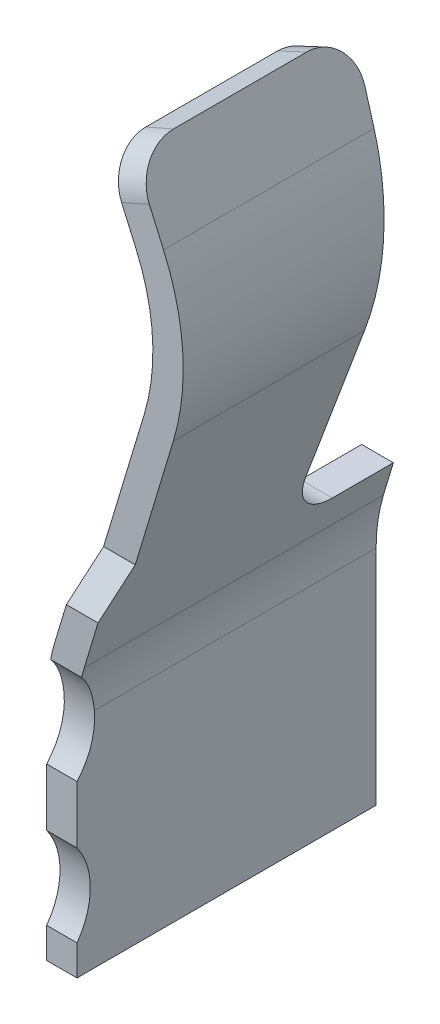
ISO-10303-21;
HEADER;
FILE_DESCRIPTION(('STEP AP214'),'2;1');
FILE_NAME('part.step','',(''),(''),'','','');
FILE_SCHEMA(('AUTOMOTIVE_DESIGN { 1 0 10303 214 1 1 1 1 }'));
ENDSEC;
DATA;
#1=APPLICATION_CONTEXT('core data for automotive mechanical design processes');
#2=APPLICATION_PROTOCOL_DEFINITION('international standard','automotive_design',2000,#1);
#3=PRODUCT_CONTEXT('',#1,'mechanical');
#4=PRODUCT('Part','Part','',(#3));
#5=PRODUCT_RELATED_PRODUCT_CATEGORY('part','',(#4));
#6=PRODUCT_DEFINITION_FORMATION('','',#4);
#7=PRODUCT_DEFINITION_CONTEXT('part definition',#1,'design');
#8=PRODUCT_DEFINITION('design','',#6,#7);
#9=PRODUCT_DEFINITION_SHAPE('','',#8);
#10=(LENGTH_UNIT() NAMED_UNIT(*) SI_UNIT(.MILLI.,.METRE.));
#11=(NAMED_UNIT(*) PLANE_ANGLE_UNIT() SI_UNIT($,.RADIAN.));
#12=(NAMED_UNIT(*) SI_UNIT($,.STERADIAN.) SOLID_ANGLE_UNIT());
#13=UNCERTAINTY_MEASURE_WITH_UNIT(LENGTH_MEASURE(1.E-05),#10,'distance_accuracy_value','');
#14=(GEOMETRIC_REPRESENTATION_CONTEXT(3) GLOBAL_UNCERTAINTY_ASSIGNED_CONTEXT((#13)) GLOBAL_UNIT_ASSIGNED_CONTEXT((#10,
#11,#12)) REPRESENTATION_CONTEXT('',''));
#15=CARTESIAN_POINT('',(0.,0.,0.));
#16=DIRECTION('',(0.,0.,1.));
#17=DIRECTION('',(1.,0.,0.));
#18=AXIS2_PLACEMENT_3D('',#15,#16,#17);
#19=CARTESIAN_POINT('',(-4.39613725867002,3.53312166947706,-0.236832722369338));
#20=DIRECTION('',(-0.914255270392899,-0.402239697454472,0.0483789866630426));
#21=DIRECTION('',(0.402711251685501,-0.915327071470027,0.));
#22=AXIS2_PLACEMENT_3D('',#19,#20,#21);
#23=CYLINDRICAL_SURFACE('',#22,0.2);
#24=CARTESIAN_POINT('',(-4.40964147732527,3.50329761180303,-0.434687053017797));
#25=CARTESIAN_POINT('',(-4.46071840447187,3.6193909515076,-0.448650066039084));
#26=CARTESIAN_POINT('',(-4.49898718351819,3.70637250294574,-0.363398989614743));
#27=CARTESIAN_POINT('',(-4.49898718351818,3.70637250294574,-0.235652283248446));
#28=(BOUNDED_CURVE() B_SPLINE_CURVE(3,(#24,#25,#26,#27),.UNSPECIFIED.,.F.,
.F.) B_SPLINE_CURVE_WITH_KNOTS((4,4),(3.0320715031167,4.71238898038462),
.UNSPECIFIED.) CURVE() GEOMETRIC_REPRESENTATION_ITEM() RATIONAL_B_SPLINE_CURVE((1.,
0.778229742533871,0.778229742533871,1.)) REPRESENTATION_ITEM(''));
#29=CARTESIAN_POINT('',(-4.40964147732527,3.50329761180303,-0.434687053017797));
#30=VERTEX_POINT('',#29);
#31=CARTESIAN_POINT('',(-4.49898718351818,3.70637250294574,-0.235652283248446));
#32=VERTEX_POINT('',#31);
#33=EDGE_CURVE('E452',#30,#32,#28,.T.);
#34=ORIENTED_EDGE('',*,*,#33,.F.);
#35=DIRECTION('',(0.914255270392898,0.402239697454473,-0.0483789866630426));
#36=VECTOR('',#35,1.);
#37=CARTESIAN_POINT('',(-28.457177596038,-7.07676024092296,0.837819069551529));
#38=LINE('',#37,#36);
#39=CARTESIAN_POINT('',(-4.54694053804578,3.44289092405021,-0.427421697659669));
#40=VERTEX_POINT('',#39);
#41=EDGE_CURVE('E11',#40,#30,#38,.T.);
#42=ORIENTED_EDGE('',*,*,#41,.F.);
#43=CARTESIAN_POINT('',(-4.63628624423869,3.64596581519291,-0.228386927890318));
#44=CARTESIAN_POINT('',(-4.63628624423869,3.64596581519291,-0.356133634256616));
#45=CARTESIAN_POINT('',(-4.59801746519237,3.55898426375477,-0.441384710680957));
#46=CARTESIAN_POINT('',(-4.54694053804578,3.44289092405021,-0.427421697659669));
#47=(BOUNDED_CURVE() B_SPLINE_CURVE(3,(#43,#44,#45,#46),.UNSPECIFIED.,.F.,
.F.) B_SPLINE_CURVE_WITH_KNOTS((4,4),(1.57079632679495,3.25111380406287),
.UNSPECIFIED.) CURVE() GEOMETRIC_REPRESENTATION_ITEM() RATIONAL_B_SPLINE_CURVE((1.,
0.778229742533869,0.778229742533869,1.)) REPRESENTATION_ITEM(''));
#48=CARTESIAN_POINT('',(-4.63628624423869,3.64596581519291,-0.228386927890318));
#49=VERTEX_POINT('',#48);
#50=EDGE_CURVE('E401',#49,#40,#47,.T.);
#51=ORIENTED_EDGE('',*,*,#50,.F.);
#52=DIRECTION('',(-0.914255270392898,-0.402239697454473,0.0483789866630426));
#53=VECTOR('',#52,1.);
#54=CARTESIAN_POINT('',(-4.47667950900712,3.71618708377106,-0.236832722369339));
#55=LINE('',#54,#53);
#56=EDGE_CURVE('E446',#32,#49,#55,.T.);
#57=ORIENTED_EDGE('',*,*,#56,.F.);
#58=EDGE_LOOP('',(#34,#42,#51,#57));
#59=FACE_BOUND('',#58,.T.);
#60=ADVANCED_FACE('F16',(#59),#23,.T.);
#61=CARTESIAN_POINT('',(-4.41844493318109,3.52330708865174,0.423604352914838));
#62=DIRECTION('',(0.915327071470027,0.402711251685502,0.));
#63=DIRECTION('',(-0.402711251685502,0.915327071470027,0.));
#64=AXIS2_PLACEMENT_3D('',#61,#62,#63);
#65=CYLINDRICAL_SURFACE('',#64,0.2);
#66=CARTESIAN_POINT('',(-4.55574399390159,3.46290040089891,0.423604352914837));
#67=DIRECTION('',(-0.915327071470027,-0.402711251685502,0.));
#68=DIRECTION('',(-0.402711251685502,0.915327071470027,0.));
#69=AXIS2_PLACEMENT_3D('',#66,#67,#68);
#70=CIRCLE('',#69,0.2);
#71=CARTESIAN_POINT('',(-4.55574399390159,3.46290040089891,0.623604352914837));
#72=VERTEX_POINT('',#71);
#73=CARTESIAN_POINT('',(-4.63628624423869,3.64596581519291,0.423604352914837));
#74=VERTEX_POINT('',#73);
#75=EDGE_CURVE('E398',#72,#74,#70,.T.);
#76=ORIENTED_EDGE('',*,*,#75,.F.);
#77=DIRECTION('',(-0.915327071470027,-0.402711251685503,0.));
#78=VECTOR('',#77,1.);
#79=CARTESIAN_POINT('',(-29.1730633966531,-7.36784176638169,0.623604352914803));
#80=LINE('',#79,#78);
#81=CARTESIAN_POINT('',(-4.41844493318109,3.52330708865174,0.623604352914837));
#82=VERTEX_POINT('',#81);
#83=EDGE_CURVE('E26',#82,#72,#80,.T.);
#84=ORIENTED_EDGE('',*,*,#83,.F.);
#85=CARTESIAN_POINT('',(-4.41844493318109,3.52330708865174,0.423604352914838));
#86=DIRECTION('',(0.915327071470027,0.402711251685502,0.));
#87=DIRECTION('',(0.402711251685502,-0.915327071470027,0.));
#88=AXIS2_PLACEMENT_3D('',#85,#86,#87);
#89=CIRCLE('',#88,0.2);
#90=CARTESIAN_POINT('',(-4.49898718351818,3.70637250294574,0.423604352914837));
#91=VERTEX_POINT('',#90);
#92=EDGE_CURVE('E392',#91,#82,#89,.T.);
#93=ORIENTED_EDGE('',*,*,#92,.F.);
#94=DIRECTION('',(0.915327071470027,0.402711251685503,0.));
#95=VECTOR('',#94,1.);
#96=CARTESIAN_POINT('',(-4.49898718351818,3.70637250294574,0.423604352914837));
#97=LINE('',#96,#95);
#98=EDGE_CURVE('E443',#74,#91,#97,.T.);
#99=ORIENTED_EDGE('',*,*,#98,.F.);
#100=EDGE_LOOP('',(#76,#84,#93,#99));
#101=FACE_BOUND('',#100,.T.);
#102=ADVANCED_FACE('F515',(#101),#65,.T.);
#103=CARTESIAN_POINT('',(-33.27,1.65634067151207,-0.212546111318104));
#104=DIRECTION('',(0.,-1.,0.));
#105=DIRECTION('',(0.,0.,-1.));
#106=AXIS2_PLACEMENT_3D('',#103,#104,#105);
#107=PLANE('',#106);
#108=DIRECTION('',(0.,0.,-1.));
#109=VECTOR('',#108,1.);
#110=CARTESIAN_POINT('',(-4.73150340910558,1.65634067151207,-0.740000000000021));
#111=LINE('',#110,#109);
#112=CARTESIAN_POINT('',(-4.73150340910558,1.65634067151207,-0.438042305987955));
#113=VERTEX_POINT('',#112);
#114=CARTESIAN_POINT('',(-4.73150340910558,1.65634067151207,-0.740000000000021));
#115=VERTEX_POINT('',#114);
#116=EDGE_CURVE('E466',#113,#115,#111,.T.);
#117=ORIENTED_EDGE('',*,*,#116,.F.);
#118=DIRECTION('',(1.,0.,0.));
#119=VECTOR('',#118,1.);
#120=CARTESIAN_POINT('',(-4.57483507894155,1.65634067151207,-0.438042305987954));
#121=LINE('',#120,#119);
#122=CARTESIAN_POINT('',(-4.57483507894154,1.65634067151207,-0.438042305987954));
#123=VERTEX_POINT('',#122);
#124=EDGE_CURVE('E639',#113,#123,#121,.T.);
#125=ORIENTED_EDGE('',*,*,#124,.T.);
#126=DIRECTION('',(0.,0.,1.));
#127=VECTOR('',#126,1.);
#128=CARTESIAN_POINT('',(-4.57483507894154,1.65634067151207,-0.74000000000002));
#129=LINE('',#128,#127);
#130=CARTESIAN_POINT('',(-4.57483507894154,1.65634067151207,-0.74000000000002));
#131=VERTEX_POINT('',#130);
#132=EDGE_CURVE('E435',#131,#123,#129,.T.);
#133=ORIENTED_EDGE('',*,*,#132,.F.);
#134=DIRECTION('',(-1.,0.,0.));
#135=VECTOR('',#134,1.);
#136=CARTESIAN_POINT('',(-3.81,1.65634067151207,-0.740000000000019));
#137=LINE('',#136,#135);
#138=EDGE_CURVE('E409',#131,#115,#137,.T.);
#139=ORIENTED_EDGE('',*,*,#138,.T.);
#140=EDGE_LOOP('',(#117,#125,#133,#139));
#141=FACE_BOUND('',#140,.T.);
#142=ADVANCED_FACE('F322',(#141),#107,.F.);
#143=CARTESIAN_POINT('',(-33.27,3.70637250294571,-0.459111687165995));
#144=DIRECTION('',(0.,0.119413416546905,0.992844618230162));
#145=DIRECTION('',(1.,0.,0.));
#146=AXIS2_PLACEMENT_3D('',#143,#144,#145);
#147=PLANE('',#146);
#148=DIRECTION('',(0.286748539926818,0.951150986717315,-0.11439875574724));
#149=VECTOR('',#148,1.);
#150=CARTESIAN_POINT('',(-4.60587763511194,1.55337185451571,-0.200161637444148));
#151=LINE('',#150,#149);
#152=CARTESIAN_POINT('',(-4.50733997726959,1.88022335482146,-0.239473382341922));
#153=VERTEX_POINT('',#152);
#154=CARTESIAN_POINT('',(-4.29979823954621,2.56864369924933,-0.322272466749581));
#155=VERTEX_POINT('',#154);
#156=EDGE_CURVE('E441',#153,#155,#151,.T.);
#157=ORIENTED_EDGE('',*,*,#156,.F.);
#158=DIRECTION('',(-1.,0.,0.));
#159=VECTOR('',#158,1.);
#160=CARTESIAN_POINT('',(-4.73150340910559,1.88022335482146,-0.239473382341922));
#161=LINE('',#160,#159);
#162=CARTESIAN_POINT('',(-4.66400830743363,1.88022335482146,-0.239473382341922));
#163=VERTEX_POINT('',#162);
#164=EDGE_CURVE('E349',#153,#163,#161,.T.);
#165=ORIENTED_EDGE('',*,*,#164,.T.);
#166=DIRECTION('',(-0.28674853992682,-0.951150986717314,0.11439875574724));
#167=VECTOR('',#166,1.);
#168=CARTESIAN_POINT('',(-4.74966395488851,1.59610175610151,-0.205300934614505));
#169=LINE('',#168,#167);
#170=CARTESIAN_POINT('',(-4.44341373590366,2.61194022573825,-0.327479914176623));
#171=VERTEX_POINT('',#170);
#172=EDGE_CURVE('E203',#171,#163,#169,.T.);
#173=ORIENTED_EDGE('',*,*,#172,.F.);
#174=CARTESIAN_POINT('',(-4.48552330681658,3.30329498734983,-0.410631932744419));
#175=CARTESIAN_POINT('',(-4.3885450102924,3.08287189317973,-0.384120760424612));
#176=CARTESIAN_POINT('',(-4.37390448882344,2.84250387207174,-0.355210731501567));
#177=CARTESIAN_POINT('',(-4.44341373590366,2.61194022573825,-0.327479914176623));
#178=(BOUNDED_CURVE() B_SPLINE_CURVE(3,(#174,#175,#176,#177),.UNSPECIFIED.,.F.,
.F.) B_SPLINE_CURVE_WITH_KNOTS((4,4),(4.29791199977039,5.00519872138853),
.UNSPECIFIED.) CURVE() GEOMETRIC_REPRESENTATION_ITEM() RATIONAL_B_SPLINE_CURVE((1.,
0.958744787021091,0.958744787021091,1.)) REPRESENTATION_ITEM(''));
#179=CARTESIAN_POINT('',(-4.48552330681658,3.30329498734983,-0.410631932744419));
#180=VERTEX_POINT('',#179);
#181=EDGE_CURVE('E213',#180,#171,#178,.T.);
#182=ORIENTED_EDGE('',*,*,#181,.F.);
#183=DIRECTION('',(0.400292818236851,-0.909830186054405,0.109428936813833));
#184=VECTOR('',#183,1.);
#185=CARTESIAN_POINT('',(-4.49995081965594,3.33608744850051,-0.414576013974334));
#186=LINE('',#185,#184);
#187=EDGE_CURVE('E408',#40,#180,#186,.T.);
#188=ORIENTED_EDGE('',*,*,#187,.F.);
#189=ORIENTED_EDGE('',*,*,#41,.T.);
#190=DIRECTION('',(-0.40029281823685,0.909830186054405,-0.109428936813833));
#191=VECTOR('',#190,1.);
#192=CARTESIAN_POINT('',(-4.36233351008822,3.39577078475993,-0.421754368938235));
#193=LINE('',#192,#191);
#194=CARTESIAN_POINT('',(-4.34822424609608,3.36370167510267,-0.417897288102547));
#195=VERTEX_POINT('',#194);
#196=EDGE_CURVE('E448',#195,#30,#193,.T.);
#197=ORIENTED_EDGE('',*,*,#196,.F.);
#198=CARTESIAN_POINT('',(-4.29979823954621,2.56864369924933,-0.322272466749581));
#199=CARTESIAN_POINT('',(-4.21986260540396,2.83379189253285,-0.354162906673267));
#200=CARTESIAN_POINT('',(-4.23669920509327,3.11021511680704,-0.387409439934769));
#201=CARTESIAN_POINT('',(-4.34822424609608,3.36370167510267,-0.417897288102547));
#202=(BOUNDED_CURVE() B_SPLINE_CURVE(3,(#198,#199,#200,#201),.UNSPECIFIED.,.F.,
.F.) B_SPLINE_CURVE_WITH_KNOTS((4,4),(1.27798658579106,1.98527330740919),
.UNSPECIFIED.) CURVE() GEOMETRIC_REPRESENTATION_ITEM() RATIONAL_B_SPLINE_CURVE((1.,
0.958744787021091,0.958744787021091,1.)) REPRESENTATION_ITEM(''));
#203=EDGE_CURVE('E429',#155,#195,#202,.T.);
#204=ORIENTED_EDGE('',*,*,#203,.F.);
#205=EDGE_LOOP('',(#157,#165,#173,#182,#188,#189,#197,#204));
#206=FACE_BOUND('',#205,.T.);
#207=ADVANCED_FACE('F554',(#206),#147,.F.);
#208=CARTESIAN_POINT('',(-33.27,1.94413292378283,0.623604352914797));
#209=DIRECTION('',(0.,0.,-1.));
#210=DIRECTION('',(0.,-1.,0.));
#211=AXIS2_PLACEMENT_3D('',#208,#209,#210);
#212=PLANE('',#211);
#213=DIRECTION('',(0.4027112516855,-0.915327071470028,0.));
#214=VECTOR('',#213,1.);
#215=CARTESIAN_POINT('',(-4.34822424609608,3.36370167510267,0.623604352914838));
#216=LINE('',#215,#214);
#217=CARTESIAN_POINT('',(-4.34822424609608,3.36370167510267,0.623604352914838));
#218=VERTEX_POINT('',#217);
#219=EDGE_CURVE('E396',#82,#218,#216,.T.);
#220=ORIENTED_EDGE('',*,*,#219,.F.);
#221=ORIENTED_EDGE('',*,*,#83,.T.);
#222=DIRECTION('',(-0.402711251685501,0.915327071470028,0.));
#223=VECTOR('',#222,1.);
#224=CARTESIAN_POINT('',(-4.48552330681658,3.30329498734984,0.623604352914837));
#225=LINE('',#224,#223);
#226=CARTESIAN_POINT('',(-4.48552330681659,3.30329498734983,0.623604352914837));
#227=VERTEX_POINT('',#226);
#228=EDGE_CURVE('E402',#227,#72,#225,.T.);
#229=ORIENTED_EDGE('',*,*,#228,.F.);
#230=CARTESIAN_POINT('',(-5.40085037828662,2.90058373566433,0.623604352914836));
#231=DIRECTION('',(0.,0.,1.));
#232=DIRECTION('',(-1.,0.,0.));
#233=AXIS2_PLACEMENT_3D('',#230,#231,#232);
#234=CIRCLE('',#233,1.);
#235=CARTESIAN_POINT('',(-4.44341373590366,2.61194022573825,0.623604352914837));
#236=VERTEX_POINT('',#235);
#237=EDGE_CURVE('E424',#236,#227,#234,.T.);
#238=ORIENTED_EDGE('',*,*,#237,.F.);
#239=DIRECTION('',(0.28864350992609,0.957436642382956,0.));
#240=VECTOR('',#239,1.);
#241=CARTESIAN_POINT('',(-4.76743664238296,1.53714937485737,0.623604352914836));
#242=LINE('',#241,#240);
#243=CARTESIAN_POINT('',(-4.64474115022836,1.94413292378283,0.623604352914837));
#244=VERTEX_POINT('',#243);
#245=EDGE_CURVE('E343',#244,#236,#242,.T.);
#246=ORIENTED_EDGE('',*,*,#245,.F.);
#247=DIRECTION('',(1.,0.,0.));
#248=VECTOR('',#247,1.);
#249=CARTESIAN_POINT('',(-33.27,1.94413292378283,0.623604352914797));
#250=LINE('',#249,#248);
#251=CARTESIAN_POINT('',(-4.48807282006433,1.94413292378283,0.623604352914837));
#252=VERTEX_POINT('',#251);
#253=EDGE_CURVE('E54',#244,#252,#250,.T.);
#254=ORIENTED_EDGE('',*,*,#253,.T.);
#255=DIRECTION('',(-0.288643509926088,-0.957436642382956,0.));
#256=VECTOR('',#255,1.);
#257=CARTESIAN_POINT('',(-4.62382114602552,1.49385284836845,0.623604352914837));
#258=LINE('',#257,#256);
#259=CARTESIAN_POINT('',(-4.29979823954622,2.56864369924933,0.623604352914837));
#260=VERTEX_POINT('',#259);
#261=EDGE_CURVE('E470',#260,#252,#258,.T.);
#262=ORIENTED_EDGE('',*,*,#261,.F.);
#263=CARTESIAN_POINT('',(-5.40085037828662,2.90058373566433,0.623604352914836));
#264=DIRECTION('',(0.,0.,-1.));
#265=DIRECTION('',(-1.,0.,0.));
#266=AXIS2_PLACEMENT_3D('',#263,#264,#265);
#267=CIRCLE('',#266,1.15);
#268=EDGE_CURVE('E416',#218,#260,#267,.T.);
#269=ORIENTED_EDGE('',*,*,#268,.F.);
#270=EDGE_LOOP('',(#220,#221,#229,#238,#246,#254,#262,#269));
#271=FACE_BOUND('',#270,.T.);
#272=ADVANCED_FACE('F547',(#271),#212,.F.);
#273=CARTESIAN_POINT('',(-33.27,1.7003498353216,0.749999999999972));
#274=DIRECTION('',(0.,-0.460287319631494,-0.887770005906065));
#275=DIRECTION('',(0.,-0.887770005906065,0.460287319631494));
#276=AXIS2_PLACEMENT_3D('',#273,#274,#275);
#277=PLANE('',#276);
#278=ORIENTED_EDGE('',*,*,#253,.F.);
#279=DIRECTION('',(0.258541028225373,0.857586072334425,-0.444637678635293));
#280=VECTOR('',#279,1.);
#281=CARTESIAN_POINT('',(-4.58642343830644,2.13757401070795,0.523309818502746));
#282=LINE('',#281,#280);
#283=CARTESIAN_POINT('',(-4.71242108767926,1.7196371362757,0.73999999999998));
#284=VERTEX_POINT('',#283);
#285=EDGE_CURVE('E235',#284,#244,#282,.T.);
#286=ORIENTED_EDGE('',*,*,#285,.F.);
#287=DIRECTION('',(-1.,0.,0.));
#288=VECTOR('',#287,1.);
#289=CARTESIAN_POINT('',(-3.81,1.7196371362757,0.739999999999981));
#290=LINE('',#289,#288);
#291=CARTESIAN_POINT('',(-4.55575275751523,1.7196371362757,0.73999999999998));
#292=VERTEX_POINT('',#291);
#293=EDGE_CURVE('E428',#292,#284,#290,.T.);
#294=ORIENTED_EDGE('',*,*,#293,.F.);
#295=DIRECTION('',(-0.258541028225372,-0.857586072334425,0.444637678635293));
#296=VECTOR('',#295,1.);
#297=CARTESIAN_POINT('',(-4.4402273619162,2.10283732290249,0.541319952677682));
#298=LINE('',#297,#296);
#299=EDGE_CURVE('E226',#252,#292,#298,.T.);
#300=ORIENTED_EDGE('',*,*,#299,.F.);
#301=EDGE_LOOP('',(#278,#286,#294,#300));
#302=FACE_BOUND('',#301,.T.);
#303=ADVANCED_FACE('F540',(#302),#277,.F.);
#304=CARTESIAN_POINT('',(-3.81,1.24850586493128,0.739999999999981));
#305=DIRECTION('',(0.,0.,-1.));
#306=DIRECTION('',(0.,-1.,0.));
#307=AXIS2_PLACEMENT_3D('',#304,#305,#306);
#308=PLANE('',#307);
#309=DIRECTION('',(0.,1.,0.));
#310=VECTOR('',#309,1.);
#311=CARTESIAN_POINT('',(-4.66,0.145965815192914,0.73999999999998));
#312=LINE('',#311,#310);
#313=CARTESIAN_POINT('',(-4.66,0.145965815192914,0.73999999999998));
#314=VERTEX_POINT('',#313);
#315=CARTESIAN_POINT('',(-4.66,0.296740599868486,0.73999999999998));
#316=VERTEX_POINT('',#315);
#317=EDGE_CURVE('E270',#314,#316,#312,.T.);
#318=ORIENTED_EDGE('',*,*,#317,.T.);
#319=DIRECTION('',(-1.,0.,0.));
#320=VECTOR('',#319,1.);
#321=CARTESIAN_POINT('',(-33.27,0.296740599868486,0.73999999999994));
#322=LINE('',#321,#320);
#323=CARTESIAN_POINT('',(-4.81,0.296740599868486,0.739999999999979));
#324=VERTEX_POINT('',#323);
#325=EDGE_CURVE('E377',#316,#324,#322,.T.);
#326=ORIENTED_EDGE('',*,*,#325,.T.);
#327=DIRECTION('',(0.,-1.,0.));
#328=VECTOR('',#327,1.);
#329=CARTESIAN_POINT('',(-4.81,0.145965815192914,0.739999999999979));
#330=LINE('',#329,#328);
#331=CARTESIAN_POINT('',(-4.81,0.145965815192914,0.739999999999979));
#332=VERTEX_POINT('',#331);
#333=EDGE_CURVE('E415',#324,#332,#330,.T.);
#334=ORIENTED_EDGE('',*,*,#333,.T.);
#335=DIRECTION('',(1.,0.,0.));
#336=VECTOR('',#335,1.);
#337=CARTESIAN_POINT('',(-4.66,0.145965815192914,0.73999999999998));
#338=LINE('',#337,#336);
#339=EDGE_CURVE('E590',#332,#314,#338,.T.);
#340=ORIENTED_EDGE('',*,*,#339,.T.);
#341=EDGE_LOOP('',(#318,#326,#334,#340));
#342=FACE_BOUND('',#341,.T.);
#343=ADVANCED_FACE('F507',(#342),#308,.F.);
#344=CARTESIAN_POINT('',(-3.81,1.24850586493128,-0.740000000000019));
#345=DIRECTION('',(0.,0.,-1.));
#346=DIRECTION('',(0.,-1.,0.));
#347=AXIS2_PLACEMENT_3D('',#344,#345,#346);
#348=PLANE('',#347);
#349=ORIENTED_EDGE('',*,*,#138,.F.);
#350=DIRECTION('',(0.288643509926088,0.957436642382956,0.));
#351=VECTOR('',#350,1.);
#352=CARTESIAN_POINT('',(-4.62382114602551,1.49385284836845,-0.74000000000002));
#353=LINE('',#352,#351);
#354=CARTESIAN_POINT('',(-4.62382114602551,1.49385284836845,-0.74000000000002));
#355=VERTEX_POINT('',#354);
#356=EDGE_CURVE('E442',#355,#131,#353,.T.);
#357=ORIENTED_EDGE('',*,*,#356,.F.);
#358=CARTESIAN_POINT('',(-3.81,1.24850586493128,-0.740000000000019));
#359=DIRECTION('',(0.,0.,-1.));
#360=DIRECTION('',(1.,0.,0.));
#361=AXIS2_PLACEMENT_3D('',#358,#359,#360);
#362=CIRCLE('',#361,0.85);
#363=CARTESIAN_POINT('',(-4.66,1.24850586493128,-0.74000000000002));
#364=VERTEX_POINT('',#363);
#365=EDGE_CURVE('E453',#364,#355,#362,.T.);
#366=ORIENTED_EDGE('',*,*,#365,.F.);
#367=DIRECTION('',(0.,1.,0.));
#368=VECTOR('',#367,1.);
#369=CARTESIAN_POINT('',(-4.66,0.145965815192914,-0.74000000000002));
#370=LINE('',#369,#368);
#371=CARTESIAN_POINT('',(-4.66,0.145965815192914,-0.74000000000002));
#372=VERTEX_POINT('',#371);
#373=EDGE_CURVE('E266',#372,#364,#370,.T.);
#374=ORIENTED_EDGE('',*,*,#373,.F.);
#375=DIRECTION('',(1.,0.,0.));
#376=VECTOR('',#375,1.);
#377=CARTESIAN_POINT('',(-4.66,0.145965815192914,-0.74000000000002));
#378=LINE('',#377,#376);
#379=CARTESIAN_POINT('',(-4.81,0.145965815192914,-0.740000000000021));
#380=VERTEX_POINT('',#379);
#381=EDGE_CURVE('E681',#380,#372,#378,.T.);
#382=ORIENTED_EDGE('',*,*,#381,.F.);
#383=DIRECTION('',(0.,-1.,0.));
#384=VECTOR('',#383,1.);
#385=CARTESIAN_POINT('',(-4.81,0.145965815192914,-0.740000000000021));
#386=LINE('',#385,#384);
#387=CARTESIAN_POINT('',(-4.81,1.24850586493128,-0.740000000000021));
#388=VERTEX_POINT('',#387);
#389=EDGE_CURVE('E40',#388,#380,#386,.T.);
#390=ORIENTED_EDGE('',*,*,#389,.F.);
#391=CARTESIAN_POINT('',(-3.81,1.24850586493128,-0.740000000000019));
#392=DIRECTION('',(0.,0.,1.));
#393=DIRECTION('',(1.,0.,0.));
#394=AXIS2_PLACEMENT_3D('',#391,#392,#393);
#395=CIRCLE('',#394,1.);
#396=CARTESIAN_POINT('',(-4.76743664238296,1.53714937485737,-0.740000000000021));
#397=VERTEX_POINT('',#396);
#398=EDGE_CURVE('E342',#397,#388,#395,.T.);
#399=ORIENTED_EDGE('',*,*,#398,.F.);
#400=DIRECTION('',(-0.28864350992609,-0.957436642382956,0.));
#401=VECTOR('',#400,1.);
#402=CARTESIAN_POINT('',(-4.76743664238296,1.53714937485737,-0.740000000000021));
#403=LINE('',#402,#401);
#404=EDGE_CURVE('E463',#115,#397,#403,.T.);
#405=ORIENTED_EDGE('',*,*,#404,.F.);
#406=EDGE_LOOP('',(#349,#357,#366,#374,#382,#390,#399,#405));
#407=FACE_BOUND('',#406,.T.);
#408=ADVANCED_FACE('F494',(#407),#348,.T.);
#409=CARTESIAN_POINT('',(-4.81,0.145965815192914,-0.740000000000021));
#410=DIRECTION('',(1.,0.,0.));
#411=DIRECTION('',(0.,1.,0.));
#412=AXIS2_PLACEMENT_3D('',#409,#410,#411);
#413=PLANE('',#412);
#414=DIRECTION('',(0.,-1.,0.));
#415=VECTOR('',#414,1.);
#416=CARTESIAN_POINT('',(-4.81,0.145965815192914,0.739999999999979));
#417=LINE('',#416,#415);
#418=CARTESIAN_POINT('',(-4.81,0.988055123608201,0.739999999999979));
#419=VERTEX_POINT('',#418);
#420=CARTESIAN_POINT('',(-4.81,0.703259400131467,0.739999999999979));
#421=VERTEX_POINT('',#420);
#422=EDGE_CURVE('E390',#419,#421,#417,.T.);
#423=ORIENTED_EDGE('',*,*,#422,.F.);
#424=CARTESIAN_POINT('',(-4.81,1.21669179396546,0.995153761033096));
#425=DIRECTION('',(1.,0.,0.));
#426=DIRECTION('',(0.,1.,0.));
#427=AXIS2_PLACEMENT_3D('',#424,#425,#426);
#428=CIRCLE('',#427,0.342604974863759);
#429=CARTESIAN_POINT('',(-4.81,1.24850586493128,0.654029100989324));
#430=VERTEX_POINT('',#429);
#431=EDGE_CURVE('E297',#419,#430,#428,.T.);
#432=ORIENTED_EDGE('',*,*,#431,.T.);
#433=DIRECTION('',(0.,0.,1.));
#434=VECTOR('',#433,1.);
#435=CARTESIAN_POINT('',(-4.81,1.24850586493128,-0.740000000000021));
#436=LINE('',#435,#434);
#437=EDGE_CURVE('E334',#388,#430,#436,.T.);
#438=ORIENTED_EDGE('',*,*,#437,.F.);
#439=ORIENTED_EDGE('',*,*,#389,.T.);
#440=DIRECTION('',(0.,0.,1.));
#441=VECTOR('',#440,1.);
#442=CARTESIAN_POINT('',(-4.81,0.145965815192914,-0.740000000000021));
#443=LINE('',#442,#441);
#444=EDGE_CURVE('E677',#380,#332,#443,.T.);
#445=ORIENTED_EDGE('',*,*,#444,.T.);
#446=ORIENTED_EDGE('',*,*,#333,.F.);
#447=CARTESIAN_POINT('',(-4.81,0.499999999999977,1.0194268345702));
#448=DIRECTION('',(1.,0.,0.));
#449=DIRECTION('',(0.,1.,0.));
#450=AXIS2_PLACEMENT_3D('',#447,#448,#449);
#451=CIRCLE('',#450,0.345533991988848);
#452=EDGE_CURVE('E367',#324,#421,#451,.T.);
#453=ORIENTED_EDGE('',*,*,#452,.T.);
#454=EDGE_LOOP('',(#423,#432,#438,#439,#445,#446,#453));
#455=FACE_BOUND('',#454,.T.);
#456=ADVANCED_FACE('F486',(#455),#413,.F.);
#457=CARTESIAN_POINT('',(-3.81,1.24850586493128,-0.740000000000019));
#458=DIRECTION('',(0.,0.,1.));
#459=DIRECTION('',(-1.,0.,0.));
#460=AXIS2_PLACEMENT_3D('',#457,#458,#459);
#461=CYLINDRICAL_SURFACE('',#460,1.);
#462=ORIENTED_EDGE('',*,*,#437,.T.);
#463=CARTESIAN_POINT('',(-4.81,1.24850586493127,0.654029100989324));
#464=CARTESIAN_POINT('',(-4.81000007407363,1.25306932177748,0.654454497923835));
#465=CARTESIAN_POINT('',(-4.80996876472137,1.25762446546712,0.654969794425774));
#466=CARTESIAN_POINT('',(-4.80984483490432,1.26669234380872,0.656178662703507));
#467=CARTESIAN_POINT('',(-4.80975245079703,1.27120517419842,0.656871540938563));
#468=CARTESIAN_POINT('',(-4.80950808670678,1.28018764830056,0.658435530000101));
#469=CARTESIAN_POINT('',(-4.80935624289613,1.28465736694881,0.659306231418194));
#470=CARTESIAN_POINT('',(-4.80899477703104,1.29355289226453,0.661225514697385));
#471=CARTESIAN_POINT('',(-4.8087851944591,1.29797872680563,0.66227397481712));
#472=CARTESIAN_POINT('',(-4.80831002792707,1.30678583476397,0.664548502475786));
#473=CARTESIAN_POINT('',(-4.80804439252603,1.31116706334694,0.665774732832754));
#474=CARTESIAN_POINT('',(-4.80745889152882,1.31988437499395,0.668404514864849));
#475=CARTESIAN_POINT('',(-4.80713889099457,1.32422031651338,0.669808505488944));
#476=CARTESIAN_POINT('',(-4.80644641069623,1.33284654509273,0.672793524574298));
#477=CARTESIAN_POINT('',(-4.80607372137307,1.33713657245114,0.67437525453736));
#478=CARTESIAN_POINT('',(-4.80527760241854,1.34567049059148,0.677715533217567));
#479=CARTESIAN_POINT('',(-4.80485389867301,1.34991398511754,0.679475028174295));
#480=CARTESIAN_POINT('',(-4.80396321849389,1.35830019523904,0.683146652073494));
#481=CARTESIAN_POINT('',(-4.80349650719558,1.36244335249443,0.685057836907499));
#482=CARTESIAN_POINT('',(-4.80252312860201,1.37063194178074,0.6890335315101));
#483=CARTESIAN_POINT('',(-4.80201661211662,1.3746776733665,0.691097460992356));
#484=CARTESIAN_POINT('',(-4.80096713168236,1.38267128376232,0.695378434355305));
#485=CARTESIAN_POINT('',(-4.80042424735263,1.3866193519919,0.69759514404689));
#486=CARTESIAN_POINT('',(-4.79930544298223,1.39441764648526,0.702181418874191));
#487=CARTESIAN_POINT('',(-4.79872954299439,1.39826793013232,0.704550891332612));
#488=CARTESIAN_POINT('',(-4.79754802962805,1.40587073759695,0.709442454924467));
#489=CARTESIAN_POINT('',(-4.79694238918284,1.40962316741917,0.711964685588729));
#490=CARTESIAN_POINT('',(-4.79570462073635,1.4170304504751,0.717161525963165));
#491=CARTESIAN_POINT('',(-4.79507243147301,1.42068504210779,0.719836493879691));
#492=CARTESIAN_POINT('',(-4.79378470654221,1.42789683764576,0.725338623347788));
#493=CARTESIAN_POINT('',(-4.79312908847075,1.43145359950846,0.728166344681211));
#494=CARTESIAN_POINT('',(-4.79179751594577,1.43847023752972,0.733973670299352));
#495=CARTESIAN_POINT('',(-4.79112147050096,1.44192948379825,0.736954014976151));
#496=CARTESIAN_POINT('',(-4.79043911813473,1.44532846432271,0.73999999999998));
#497=B_SPLINE_CURVE_WITH_KNOTS('',3,(#463,#464,#465,#466,#467,#468,#469,#470,#471,#472,#473,
#474,#475,#476,#477,#478,#479,#480,#481,#482,#483,#484,#485,#486,#487,#488,#489,#490,#491,#492,
#493,#494,#495,#496),.UNSPECIFIED.,.F.,.F.,(4,2,2,2,2,2,2,2,2,2,2,2,2,2,2,2,4),(0.,
0.013748827736232,0.0274447569667543,0.0411095020469267,0.0547649260984996,0.0684329369744623,
0.0821353821572885,0.0958939450956067,0.109730045405059,0.123485924962941,0.137191991355335,
0.150868974599205,0.164537737053089,0.17821917870054,0.191934141578145,0.205703315519925,
0.219547147320743),.UNSPECIFIED.);
#498=CARTESIAN_POINT('',(-4.79043911813473,1.44532846432271,0.739999999999979));
#499=VERTEX_POINT('',#498);
#500=EDGE_CURVE('E358',#430,#499,#497,.T.);
#501=ORIENTED_EDGE('',*,*,#500,.T.);
#502=CARTESIAN_POINT('',(-3.81,1.24850586493128,0.739999999999981));
#503=DIRECTION('',(0.,0.,1.));
#504=DIRECTION('',(1.,0.,0.));
#505=AXIS2_PLACEMENT_3D('',#502,#503,#504);
#506=CIRCLE('',#505,1.);
#507=CARTESIAN_POINT('',(-4.76743664238296,1.53714937485737,0.739999999999979));
#508=VERTEX_POINT('',#507);
#509=EDGE_CURVE('E307',#508,#499,#506,.T.);
#510=ORIENTED_EDGE('',*,*,#509,.F.);
#511=DIRECTION('',(0.,0.,1.));
#512=VECTOR('',#511,1.);
#513=CARTESIAN_POINT('',(-4.76743664238296,1.53714937485737,-0.740000000000021));
#514=LINE('',#513,#512);
#515=EDGE_CURVE('E460',#397,#508,#514,.T.);
#516=ORIENTED_EDGE('',*,*,#515,.F.);
#517=ORIENTED_EDGE('',*,*,#398,.T.);
#518=EDGE_LOOP('',(#462,#501,#510,#516,#517));
#519=FACE_BOUND('',#518,.T.);
#520=ADVANCED_FACE('F476',(#519),#461,.T.);
#521=CARTESIAN_POINT('',(-4.76743664238296,1.53714937485737,-0.740000000000021));
#522=DIRECTION('',(0.957436642382956,-0.28864350992609,0.));
#523=DIRECTION('',(0.,0.,-1.));
#524=AXIS2_PLACEMENT_3D('',#521,#522,#523);
#525=PLANE('',#524);
#526=ORIENTED_EDGE('',*,*,#172,.T.);
#527=CARTESIAN_POINT('',(-4.66400830743363,1.88022335482146,-0.239473382341922));
#528=CARTESIAN_POINT('',(-4.66639827429865,1.87229578405696,-0.238519901512672));
#529=CARTESIAN_POINT('',(-4.66880115558451,1.86432537588468,-0.238042305987954));
#530=CARTESIAN_POINT('',(-4.67120834682183,1.85634067151208,-0.238042305987954));
#531=(BOUNDED_CURVE() B_SPLINE_CURVE(3,(#527,#528,#529,#530),.UNSPECIFIED.,.F.,
.F.) B_SPLINE_CURVE_WITH_KNOTS((4,4),(4.59268992994791,4.71238898038469),
.UNSPECIFIED.) CURVE() GEOMETRIC_REPRESENTATION_ITEM() RATIONAL_B_SPLINE_CURVE((1.,
0.998806367803328,0.998806367803328,1.)) REPRESENTATION_ITEM(''));
#532=CARTESIAN_POINT('',(-4.67120834682183,1.85634067151208,-0.238042305987954));
#533=VERTEX_POINT('',#532);
#534=EDGE_CURVE('E638',#163,#533,#531,.T.);
#535=ORIENTED_EDGE('',*,*,#534,.T.);
#536=CARTESIAN_POINT('',(-4.67120834682183,1.85634067151208,-0.238042305987954));
#537=CARTESIAN_POINT('',(-4.70652837656352,1.73918338398669,-0.238042305987954));
#538=CARTESIAN_POINT('',(-4.73150340910558,1.65634067151208,-0.320885018462573));
#539=CARTESIAN_POINT('',(-4.73150340910558,1.65634067151207,-0.438042305987955));
#540=(BOUNDED_CURVE() B_SPLINE_CURVE(3,(#536,#537,#538,#539),.UNSPECIFIED.,.F.,
.F.) B_SPLINE_CURVE_WITH_KNOTS((4,4),(4.71238898038469,6.28318530717959),
.UNSPECIFIED.) CURVE() GEOMETRIC_REPRESENTATION_ITEM() RATIONAL_B_SPLINE_CURVE((1.,
0.804737854124365,0.804737854124365,1.)) REPRESENTATION_ITEM(''));
#541=EDGE_CURVE('E633',#533,#113,#540,.T.);
#542=ORIENTED_EDGE('',*,*,#541,.T.);
#543=ORIENTED_EDGE('',*,*,#116,.T.);
#544=ORIENTED_EDGE('',*,*,#404,.T.);
#545=ORIENTED_EDGE('',*,*,#515,.T.);
#546=DIRECTION('',(-0.28864350992609,-0.957436642382956,0.));
#547=VECTOR('',#546,1.);
#548=CARTESIAN_POINT('',(-4.76743664238296,1.53714937485737,0.739999999999979));
#549=LINE('',#548,#547);
#550=EDGE_CURVE('E354',#284,#508,#549,.T.);
#551=ORIENTED_EDGE('',*,*,#550,.F.);
#552=ORIENTED_EDGE('',*,*,#285,.T.);
#553=ORIENTED_EDGE('',*,*,#245,.T.);
#554=DIRECTION('',(0.,0.,1.));
#555=VECTOR('',#554,1.);
#556=CARTESIAN_POINT('',(-4.44341373590366,2.61194022573825,-0.74000000000002));
#557=LINE('',#556,#555);
#558=EDGE_CURVE('E420',#171,#236,#557,.T.);
#559=ORIENTED_EDGE('',*,*,#558,.F.);
#560=EDGE_LOOP('',(#526,#535,#542,#543,#544,#545,#551,#552,#553,#559));
#561=FACE_BOUND('',#560,.T.);
#562=ADVANCED_FACE('F485',(#561),#525,.F.);
#563=CARTESIAN_POINT('',(-5.40085037828662,2.90058373566433,-0.740000000000021));
#564=DIRECTION('',(0.,0.,1.));
#565=DIRECTION('',(-1.,0.,0.));
#566=AXIS2_PLACEMENT_3D('',#563,#564,#565);
#567=CYLINDRICAL_SURFACE('',#566,1.);
#568=DIRECTION('',(0.,0.,1.));
#569=VECTOR('',#568,1.);
#570=CARTESIAN_POINT('',(-4.48552330681658,3.30329498734983,-0.74000000000002));
#571=LINE('',#570,#569);
#572=EDGE_CURVE('E597',#180,#227,#571,.T.);
#573=ORIENTED_EDGE('',*,*,#572,.F.);
#574=ORIENTED_EDGE('',*,*,#181,.T.);
#575=ORIENTED_EDGE('',*,*,#558,.T.);
#576=ORIENTED_EDGE('',*,*,#237,.T.);
#577=EDGE_LOOP('',(#573,#574,#575,#576));
#578=FACE_BOUND('',#577,.T.);
#579=ADVANCED_FACE('F529',(#578),#567,.F.);
#580=CARTESIAN_POINT('',(-4.48552330681658,3.30329498734984,-0.74000000000002));
#581=DIRECTION('',(0.915327071470028,0.402711251685501,0.));
#582=DIRECTION('',(0.,0.,-1.));
#583=AXIS2_PLACEMENT_3D('',#580,#581,#582);
#584=PLANE('',#583);
#585=ORIENTED_EDGE('',*,*,#228,.T.);
#586=ORIENTED_EDGE('',*,*,#75,.T.);
#587=DIRECTION('',(0.,0.,1.));
#588=VECTOR('',#587,1.);
#589=CARTESIAN_POINT('',(-4.63628624423869,3.64596581519291,-0.740000000000021));
#590=LINE('',#589,#588);
#591=EDGE_CURVE('E447',#49,#74,#590,.T.);
#592=ORIENTED_EDGE('',*,*,#591,.F.);
#593=ORIENTED_EDGE('',*,*,#50,.T.);
#594=ORIENTED_EDGE('',*,*,#187,.T.);
#595=ORIENTED_EDGE('',*,*,#572,.T.);
#596=EDGE_LOOP('',(#585,#586,#592,#593,#594,#595));
#597=FACE_BOUND('',#596,.T.);
#598=ADVANCED_FACE('F525',(#597),#584,.F.);
#599=CARTESIAN_POINT('',(-4.49898718351818,3.70637250294574,-0.74000000000002));
#600=DIRECTION('',(0.402711251685503,-0.915327071470027,0.));
#601=DIRECTION('',(0.,0.,-1.));
#602=AXIS2_PLACEMENT_3D('',#599,#600,#601);
#603=PLANE('',#602);
#604=ORIENTED_EDGE('',*,*,#591,.T.);
#605=ORIENTED_EDGE('',*,*,#98,.T.);
#606=DIRECTION('',(0.,0.,1.));
#607=VECTOR('',#606,1.);
#608=CARTESIAN_POINT('',(-4.49898718351818,3.70637250294574,-0.74000000000002));
#609=LINE('',#608,#607);
#610=EDGE_CURVE('E397',#32,#91,#609,.T.);
#611=ORIENTED_EDGE('',*,*,#610,.F.);
#612=ORIENTED_EDGE('',*,*,#56,.T.);
#613=EDGE_LOOP('',(#604,#605,#611,#612));
#614=FACE_BOUND('',#613,.T.);
#615=ADVANCED_FACE('F528',(#614),#603,.F.);
#616=CARTESIAN_POINT('',(-4.34822424609608,3.36370167510267,-0.74000000000002));
#617=DIRECTION('',(-0.915327071470028,-0.4027112516855,0.));
#618=DIRECTION('',(-0.4027112516855,0.915327071470028,0.));
#619=AXIS2_PLACEMENT_3D('',#616,#617,#618);
#620=PLANE('',#619);
#621=ORIENTED_EDGE('',*,*,#610,.T.);
#622=ORIENTED_EDGE('',*,*,#92,.T.);
#623=ORIENTED_EDGE('',*,*,#219,.T.);
#624=DIRECTION('',(0.,0.,1.));
#625=VECTOR('',#624,1.);
#626=CARTESIAN_POINT('',(-4.34822424609608,3.36370167510267,-0.74000000000002));
#627=LINE('',#626,#625);
#628=EDGE_CURVE('E418',#195,#218,#627,.T.);
#629=ORIENTED_EDGE('',*,*,#628,.F.);
#630=ORIENTED_EDGE('',*,*,#196,.T.);
#631=ORIENTED_EDGE('',*,*,#33,.T.);
#632=EDGE_LOOP('',(#621,#622,#623,#629,#630,#631));
#633=FACE_BOUND('',#632,.T.);
#634=ADVANCED_FACE('F324',(#633),#620,.F.);
#635=CARTESIAN_POINT('',(-5.40085037828662,2.90058373566433,-0.740000000000021));
#636=DIRECTION('',(0.,0.,1.));
#637=DIRECTION('',(-1.,0.,0.));
#638=AXIS2_PLACEMENT_3D('',#635,#636,#637);
#639=CYLINDRICAL_SURFACE('',#638,1.15);
#640=DIRECTION('',(0.,0.,1.));
#641=VECTOR('',#640,1.);
#642=CARTESIAN_POINT('',(-4.29979823954621,2.56864369924933,-0.74000000000002));
#643=LINE('',#642,#641);
#644=EDGE_CURVE('E472',#155,#260,#643,.T.);
#645=ORIENTED_EDGE('',*,*,#644,.F.);
#646=ORIENTED_EDGE('',*,*,#203,.T.);
#647=ORIENTED_EDGE('',*,*,#628,.T.);
#648=ORIENTED_EDGE('',*,*,#268,.T.);
#649=EDGE_LOOP('',(#645,#646,#647,#648));
#650=FACE_BOUND('',#649,.T.);
#651=ADVANCED_FACE('F18',(#650),#639,.T.);
#652=CARTESIAN_POINT('',(-4.62382114602551,1.49385284836845,-0.74000000000002));
#653=DIRECTION('',(-0.957436642382956,0.288643509926088,0.));
#654=DIRECTION('',(0.,0.,1.));
#655=AXIS2_PLACEMENT_3D('',#652,#653,#654);
#656=PLANE('',#655);
#657=ORIENTED_EDGE('',*,*,#356,.T.);
#658=ORIENTED_EDGE('',*,*,#132,.T.);
#659=CARTESIAN_POINT('',(-4.57483507894154,1.65634067151207,-0.438042305987954));
#660=CARTESIAN_POINT('',(-4.57483507894155,1.65634067151208,-0.320885018462573));
#661=CARTESIAN_POINT('',(-4.54986004639949,1.73918338398669,-0.238042305987954));
#662=CARTESIAN_POINT('',(-4.5145400166578,1.85634067151208,-0.238042305987954));
#663=(BOUNDED_CURVE() B_SPLINE_CURVE(3,(#659,#660,#661,#662),.UNSPECIFIED.,.F.,
.F.) B_SPLINE_CURVE_WITH_KNOTS((4,4),(0.,1.5707963267949),
.UNSPECIFIED.) CURVE() GEOMETRIC_REPRESENTATION_ITEM() RATIONAL_B_SPLINE_CURVE((1.,
0.804737854124365,0.804737854124365,1.)) REPRESENTATION_ITEM(''));
#664=CARTESIAN_POINT('',(-4.5145400166578,1.85634067151208,-0.238042305987954));
#665=VERTEX_POINT('',#664);
#666=EDGE_CURVE('E672',#123,#665,#663,.T.);
#667=ORIENTED_EDGE('',*,*,#666,.T.);
#668=CARTESIAN_POINT('',(-4.5145400166578,1.85634067151208,-0.238042305987954));
#669=CARTESIAN_POINT('',(-4.51213282542048,1.86432537588468,-0.238042305987954));
#670=CARTESIAN_POINT('',(-4.50972994413462,1.87229578405696,-0.238519901512672));
#671=CARTESIAN_POINT('',(-4.50733997726959,1.88022335482146,-0.239473382341922));
#672=(BOUNDED_CURVE() B_SPLINE_CURVE(3,(#668,#669,#670,#671),.UNSPECIFIED.,.F.,
.F.) B_SPLINE_CURVE_WITH_KNOTS((4,4),(1.5707963267949,1.69049537723168),
.UNSPECIFIED.) CURVE() GEOMETRIC_REPRESENTATION_ITEM() RATIONAL_B_SPLINE_CURVE((1.,
0.998806367803328,0.998806367803328,1.)) REPRESENTATION_ITEM(''));
#673=EDGE_CURVE('E690',#665,#153,#672,.T.);
#674=ORIENTED_EDGE('',*,*,#673,.T.);
#675=ORIENTED_EDGE('',*,*,#156,.T.);
#676=ORIENTED_EDGE('',*,*,#644,.T.);
#677=ORIENTED_EDGE('',*,*,#261,.T.);
#678=ORIENTED_EDGE('',*,*,#299,.T.);
#679=DIRECTION('',(0.288643509926088,0.957436642382956,0.));
#680=VECTOR('',#679,1.);
#681=CARTESIAN_POINT('',(-4.62382114602552,1.49385284836845,0.73999999999998));
#682=LINE('',#681,#680);
#683=CARTESIAN_POINT('',(-4.62382114602552,1.49385284836845,0.73999999999998));
#684=VERTEX_POINT('',#683);
#685=EDGE_CURVE('E613',#684,#292,#682,.T.);
#686=ORIENTED_EDGE('',*,*,#685,.F.);
#687=DIRECTION('',(0.,0.,1.));
#688=VECTOR('',#687,1.);
#689=CARTESIAN_POINT('',(-4.62382114602551,1.49385284836845,-0.74000000000002));
#690=LINE('',#689,#688);
#691=EDGE_CURVE('E456',#355,#684,#690,.T.);
#692=ORIENTED_EDGE('',*,*,#691,.F.);
#693=EDGE_LOOP('',(#657,#658,#667,#674,#675,#676,#677,#678,#686,#692));
#694=FACE_BOUND('',#693,.T.);
#695=ADVANCED_FACE('F498',(#694),#656,.F.);
#696=CARTESIAN_POINT('',(-3.81,1.24850586493128,-0.740000000000019));
#697=DIRECTION('',(0.,0.,1.));
#698=DIRECTION('',(-1.,0.,0.));
#699=AXIS2_PLACEMENT_3D('',#696,#697,#698);
#700=CYLINDRICAL_SURFACE('',#699,0.85);
#701=CARTESIAN_POINT('',(-3.81,1.24850586493128,0.739999999999981));
#702=DIRECTION('',(0.,0.,-1.));
#703=DIRECTION('',(1.,0.,0.));
#704=AXIS2_PLACEMENT_3D('',#701,#702,#703);
#705=CIRCLE('',#704,0.85);
#706=CARTESIAN_POINT('',(-4.63689833980291,1.44532846432271,0.73999999999998));
#707=VERTEX_POINT('',#706);
#708=EDGE_CURVE('E278',#707,#684,#705,.T.);
#709=ORIENTED_EDGE('',*,*,#708,.F.);
#710=CARTESIAN_POINT('',(-4.63689833980291,1.44532846432271,0.73999999999998));
#711=CARTESIAN_POINT('',(-4.63770626403919,1.44193422770681,0.736958271492977));
#712=CARTESIAN_POINT('',(-4.63850646911214,1.43847955797032,0.733981716742078));
#713=CARTESIAN_POINT('',(-4.64008202543596,1.43147212175921,0.728181521052563));
#714=CARTESIAN_POINT('',(-4.64085749045514,1.42792001022603,0.725357119537876));
#715=CARTESIAN_POINT('',(-4.64238010172412,1.42071753239295,0.719861180213157));
#716=CARTESIAN_POINT('',(-4.64312735244203,1.41706763678315,0.717189054883485));
#717=CARTESIAN_POINT('',(-4.64458994663634,1.40966975247443,0.711997459323955));
#718=CARTESIAN_POINT('',(-4.64530537107368,1.40592205632921,0.709477595121338));
#719=CARTESIAN_POINT('',(-4.64670065749093,1.39832873431107,0.704590332989326));
#720=CARTESIAN_POINT('',(-4.6473805620878,1.39448323442695,0.702222751522553));
#721=CARTESIAN_POINT('',(-4.6487010724489,1.38669456372953,0.697639830713606));
#722=CARTESIAN_POINT('',(-4.64934166775209,1.38275136730568,0.695424531878342));
#723=CARTESIAN_POINT('',(-4.65057975125563,1.37476761007178,0.691145978302248));
#724=CARTESIAN_POINT('',(-4.6511771616687,1.37072689023549,0.68908299779019));
#725=CARTESIAN_POINT('',(-4.65232497910548,1.36254855284206,0.685108739352039));
#726=CARTESIAN_POINT('',(-4.65287522763472,1.35841066384855,0.683197974378395));
#727=CARTESIAN_POINT('',(-4.65392643870086,1.35002514120459,0.679522568881521));
#728=CARTESIAN_POINT('',(-4.65442698180287,1.34577690210563,0.677759189022458));
#729=CARTESIAN_POINT('',(-4.65536729892383,1.33723291777901,0.674411725036838));
#730=CARTESIAN_POINT('',(-4.65580741431556,1.33293760117995,0.6728266437002));
#731=CARTESIAN_POINT('',(-4.65662501138587,1.32430048357108,0.669835440034416));
#732=CARTESIAN_POINT('',(-4.65700275964778,1.3199589695556,0.668428562333028));
#733=CARTESIAN_POINT('',(-4.65769377606368,1.31123044848354,0.665793545957877));
#734=CARTESIAN_POINT('',(-4.6580072240219,1.3068436053375,0.664564911759087));
#735=CARTESIAN_POINT('',(-4.65856779412968,1.29802547391424,0.66228611368736));
#736=CARTESIAN_POINT('',(-4.65881499871077,1.29359424805972,0.661235728608707));
#737=CARTESIAN_POINT('',(-4.65924125276348,1.28468842884699,0.659313135379343));
#738=CARTESIAN_POINT('',(-4.6594202783722,1.28021382086575,0.658440989662463));
#739=CARTESIAN_POINT('',(-4.65970831592173,1.27122235283773,0.656874652664083));
#740=CARTESIAN_POINT('',(-4.65981719074092,1.26670542744422,0.656180811490032));
#741=CARTESIAN_POINT('',(-4.65996320411892,1.25763046365103,0.654970556104519));
#742=CARTESIAN_POINT('',(-4.66000008795926,1.25307233639052,0.654454777190037));
#743=CARTESIAN_POINT('',(-4.66,1.24850586493127,0.654029100989324));
#744=B_SPLINE_CURVE_WITH_KNOTS('',3,(#710,#711,#712,#713,#714,#715,#716,#717,#718,#719,#720,
#721,#722,#723,#724,#725,#726,#727,#728,#729,#730,#731,#732,#733,#734,#735,#736,#737,#738,#739,
#740,#741,#742,#743),.UNSPECIFIED.,.F.,.F.,(4,2,2,2,2,2,2,2,2,2,2,2,2,2,2,2,4),(0.,
0.0138857173790555,0.0276939528961301,0.0414446944246546,0.0551581812170151,0.0688548176561435,
0.0825550833902356,0.0962794417972244,0.110048248811237,0.123924815747905,0.1377194453994,
0.151453492383547,0.16514859471643,0.178826575239704,0.19250933871643,0.206218766980909,
0.21997661463478),.UNSPECIFIED.);
#745=CARTESIAN_POINT('',(-4.66,1.24850586493128,0.654029100989325));
#746=VERTEX_POINT('',#745);
#747=EDGE_CURVE('E274',#707,#746,#744,.T.);
#748=ORIENTED_EDGE('',*,*,#747,.T.);
#749=DIRECTION('',(0.,0.,1.));
#750=VECTOR('',#749,1.);
#751=CARTESIAN_POINT('',(-4.66,1.24850586493128,-0.74000000000002));
#752=LINE('',#751,#750);
#753=EDGE_CURVE('E259',#364,#746,#752,.T.);
#754=ORIENTED_EDGE('',*,*,#753,.F.);
#755=ORIENTED_EDGE('',*,*,#365,.T.);
#756=ORIENTED_EDGE('',*,*,#691,.T.);
#757=EDGE_LOOP('',(#709,#748,#754,#755,#756));
#758=FACE_BOUND('',#757,.T.);
#759=ADVANCED_FACE('F276',(#758),#700,.F.);
#760=CARTESIAN_POINT('',(-4.66,0.145965815192914,-0.74000000000002));
#761=DIRECTION('',(-1.,0.,0.));
#762=DIRECTION('',(0.,0.,1.));
#763=AXIS2_PLACEMENT_3D('',#760,#761,#762);
#764=PLANE('',#763);
#765=ORIENTED_EDGE('',*,*,#753,.T.);
#766=CARTESIAN_POINT('',(-4.66,1.21669179396546,0.995153761033097));
#767=DIRECTION('',(-1.,0.,0.));
#768=DIRECTION('',(0.,0.,1.));
#769=AXIS2_PLACEMENT_3D('',#766,#767,#768);
#770=CIRCLE('',#769,0.342604974863759);
#771=CARTESIAN_POINT('',(-4.66,0.988055123608201,0.73999999999998));
#772=VERTEX_POINT('',#771);
#773=EDGE_CURVE('E263',#746,#772,#770,.T.);
#774=ORIENTED_EDGE('',*,*,#773,.T.);
#775=DIRECTION('',(0.,1.,0.));
#776=VECTOR('',#775,1.);
#777=CARTESIAN_POINT('',(-4.66,0.145965815192914,0.73999999999998));
#778=LINE('',#777,#776);
#779=CARTESIAN_POINT('',(-4.66,0.703259400131467,0.73999999999998));
#780=VERTEX_POINT('',#779);
#781=EDGE_CURVE('E306',#780,#772,#778,.T.);
#782=ORIENTED_EDGE('',*,*,#781,.F.);
#783=CARTESIAN_POINT('',(-4.66,0.499999999999977,1.0194268345702));
#784=DIRECTION('',(-1.,0.,0.));
#785=DIRECTION('',(0.,0.,1.));
#786=AXIS2_PLACEMENT_3D('',#783,#784,#785);
#787=CIRCLE('',#786,0.345533991988848);
#788=EDGE_CURVE('E386',#780,#316,#787,.T.);
#789=ORIENTED_EDGE('',*,*,#788,.T.);
#790=ORIENTED_EDGE('',*,*,#317,.F.);
#791=DIRECTION('',(0.,0.,1.));
#792=VECTOR('',#791,1.);
#793=CARTESIAN_POINT('',(-4.66,0.145965815192914,-0.74000000000002));
#794=LINE('',#793,#792);
#795=EDGE_CURVE('E271',#372,#314,#794,.T.);
#796=ORIENTED_EDGE('',*,*,#795,.F.);
#797=ORIENTED_EDGE('',*,*,#373,.T.);
#798=EDGE_LOOP('',(#765,#774,#782,#789,#790,#796,#797));
#799=FACE_BOUND('',#798,.T.);
#800=ADVANCED_FACE('F261',(#799),#764,.F.);
#801=CARTESIAN_POINT('',(-4.66,0.145965815192914,-0.74000000000002));
#802=DIRECTION('',(0.,1.,0.));
#803=DIRECTION('',(1.,0.,0.));
#804=AXIS2_PLACEMENT_3D('',#801,#802,#803);
#805=PLANE('',#804);
#806=ORIENTED_EDGE('',*,*,#339,.F.);
#807=ORIENTED_EDGE('',*,*,#444,.F.);
#808=ORIENTED_EDGE('',*,*,#381,.T.);
#809=ORIENTED_EDGE('',*,*,#795,.T.);
#810=EDGE_LOOP('',(#806,#807,#808,#809));
#811=FACE_BOUND('',#810,.T.);
#812=ADVANCED_FACE('F487',(#811),#805,.F.);
#813=CARTESIAN_POINT('',(-3.81,1.24850586493128,0.739999999999981));
#814=DIRECTION('',(0.,0.,-1.));
#815=DIRECTION('',(0.,-1.,0.));
#816=AXIS2_PLACEMENT_3D('',#813,#814,#815);
#817=PLANE('',#816);
#818=ORIENTED_EDGE('',*,*,#781,.T.);
#819=DIRECTION('',(-1.,0.,0.));
#820=VECTOR('',#819,1.);
#821=CARTESIAN_POINT('',(-33.27,0.988055123608201,0.73999999999994));
#822=LINE('',#821,#820);
#823=EDGE_CURVE('E290',#772,#419,#822,.T.);
#824=ORIENTED_EDGE('',*,*,#823,.T.);
#825=ORIENTED_EDGE('',*,*,#422,.T.);
#826=DIRECTION('',(1.,0.,0.));
#827=VECTOR('',#826,1.);
#828=CARTESIAN_POINT('',(-33.27,0.703259400131467,0.73999999999994));
#829=LINE('',#828,#827);
#830=EDGE_CURVE('E610',#421,#780,#829,.T.);
#831=ORIENTED_EDGE('',*,*,#830,.T.);
#832=EDGE_LOOP('',(#818,#824,#825,#831));
#833=FACE_BOUND('',#832,.T.);
#834=ADVANCED_FACE('F490',(#833),#817,.F.);
#835=CARTESIAN_POINT('',(-3.81,1.24850586493128,0.739999999999981));
#836=DIRECTION('',(0.,0.,-1.));
#837=DIRECTION('',(0.,-1.,0.));
#838=AXIS2_PLACEMENT_3D('',#835,#836,#837);
#839=PLANE('',#838);
#840=ORIENTED_EDGE('',*,*,#685,.T.);
#841=ORIENTED_EDGE('',*,*,#293,.T.);
#842=ORIENTED_EDGE('',*,*,#550,.T.);
#843=ORIENTED_EDGE('',*,*,#509,.T.);
#844=DIRECTION('',(1.,0.,0.));
#845=VECTOR('',#844,1.);
#846=CARTESIAN_POINT('',(-33.27,1.44532846432271,0.73999999999994));
#847=LINE('',#846,#845);
#848=EDGE_CURVE('E284',#499,#707,#847,.T.);
#849=ORIENTED_EDGE('',*,*,#848,.T.);
#850=ORIENTED_EDGE('',*,*,#708,.T.);
#851=EDGE_LOOP('',(#840,#841,#842,#843,#849,#850));
#852=FACE_BOUND('',#851,.T.);
#853=ADVANCED_FACE('F533',(#852),#839,.F.);
#854=CARTESIAN_POINT('',(-33.27,0.499999999999977,1.01942683457016));
#855=DIRECTION('',(1.,0.,0.));
#856=DIRECTION('',(0.,0.,-1.));
#857=AXIS2_PLACEMENT_3D('',#854,#855,#856);
#858=CYLINDRICAL_SURFACE('',#857,0.345533991988848);
#859=ORIENTED_EDGE('',*,*,#452,.F.);
#860=ORIENTED_EDGE('',*,*,#325,.F.);
#861=ORIENTED_EDGE('',*,*,#788,.F.);
#862=ORIENTED_EDGE('',*,*,#830,.F.);
#863=EDGE_LOOP('',(#859,#860,#861,#862));
#864=FACE_BOUND('',#863,.T.);
#865=ADVANCED_FACE('F321',(#864),#858,.F.);
#866=CARTESIAN_POINT('',(-33.27,1.21669179396546,0.995153761033057));
#867=DIRECTION('',(1.,0.,0.));
#868=DIRECTION('',(0.,0.,-1.));
#869=AXIS2_PLACEMENT_3D('',#866,#867,#868);
#870=CYLINDRICAL_SURFACE('',#869,0.342604974863759);
#871=ORIENTED_EDGE('',*,*,#431,.F.);
#872=ORIENTED_EDGE('',*,*,#823,.F.);
#873=ORIENTED_EDGE('',*,*,#773,.F.);
#874=ORIENTED_EDGE('',*,*,#747,.F.);
#875=ORIENTED_EDGE('',*,*,#848,.F.);
#876=ORIENTED_EDGE('',*,*,#500,.F.);
#877=EDGE_LOOP('',(#871,#872,#873,#874,#875,#876));
#878=FACE_BOUND('',#877,.T.);
#879=ADVANCED_FACE('F288',(#878),#870,.F.);
#880=CARTESIAN_POINT('',(-33.27,1.85634067151208,-0.438042305987994));
#881=DIRECTION('',(-1.,0.,0.));
#882=DIRECTION('',(0.,0.,1.));
#883=AXIS2_PLACEMENT_3D('',#880,#881,#882);
#884=CYLINDRICAL_SURFACE('',#883,0.2);
#885=ORIENTED_EDGE('',*,*,#673,.F.);
#886=ORIENTED_EDGE('',*,*,#666,.F.);
#887=ORIENTED_EDGE('',*,*,#124,.F.);
#888=ORIENTED_EDGE('',*,*,#541,.F.);
#889=ORIENTED_EDGE('',*,*,#534,.F.);
#890=ORIENTED_EDGE('',*,*,#164,.F.);
#891=EDGE_LOOP('',(#885,#886,#887,#888,#889,#890));
#892=FACE_BOUND('',#891,.T.);
#893=ADVANCED_FACE('F320',(#892),#884,.F.);
#894=CLOSED_SHELL('',(#60,#102,#142,#207,#272,#303,#343,#408,#456,#520,#562,#579,#598,#615,#634,
#651,#695,#759,#800,#812,#834,#853,#865,#879,#893));
#895=MANIFOLD_SOLID_BREP('B1',#894);
#896=ADVANCED_BREP_SHAPE_REPRESENTATION('',(#18,#895),#14);
#897=SHAPE_DEFINITION_REPRESENTATION(#9,#896);
ENDSEC;
END-ISO-10303-21;
